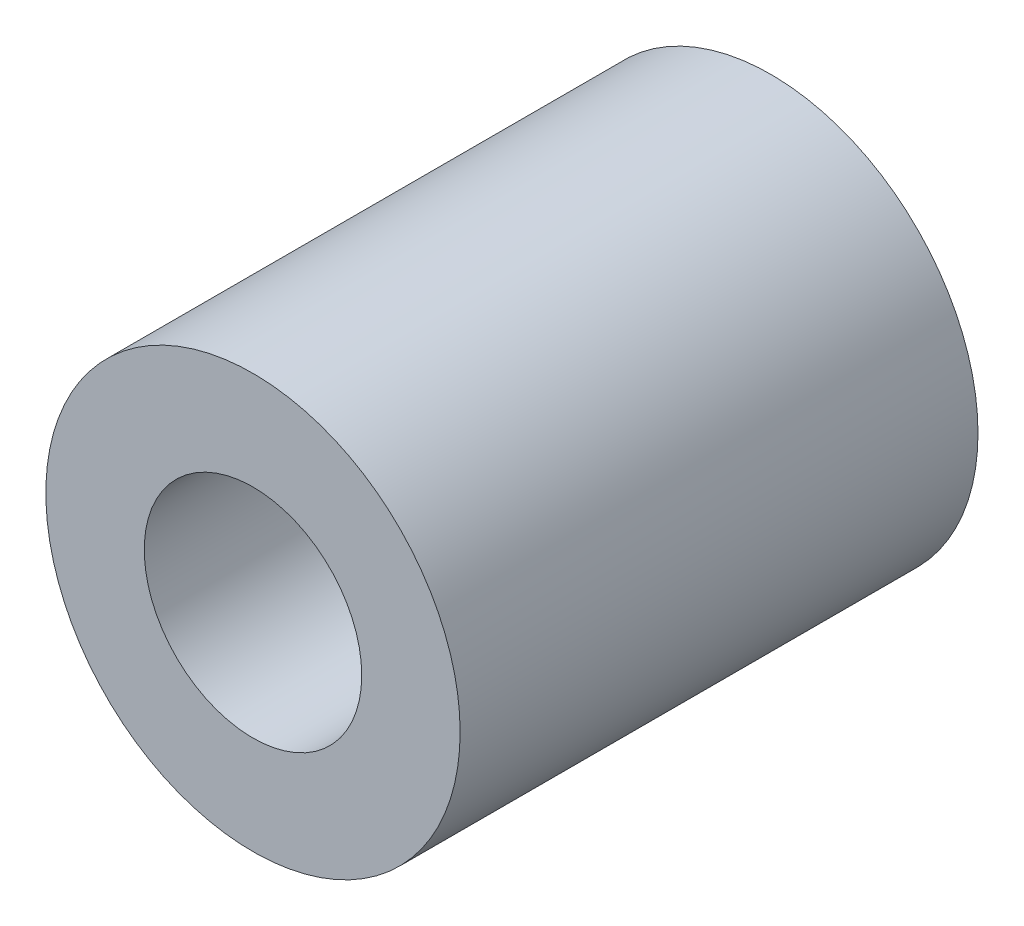
ISO-10303-21;
HEADER;
FILE_DESCRIPTION(('STEP AP214'),'2;1');
FILE_NAME('part.step','',(''),(''),'','','');
FILE_SCHEMA(('AUTOMOTIVE_DESIGN { 1 0 10303 214 1 1 1 1 }'));
ENDSEC;
DATA;
#1=APPLICATION_CONTEXT('core data for automotive mechanical design processes');
#2=APPLICATION_PROTOCOL_DEFINITION('international standard','automotive_design',2000,#1);
#3=PRODUCT_CONTEXT('',#1,'mechanical');
#4=PRODUCT('Part','Part','',(#3));
#5=PRODUCT_RELATED_PRODUCT_CATEGORY('part','',(#4));
#6=PRODUCT_DEFINITION_FORMATION('','',#4);
#7=PRODUCT_DEFINITION_CONTEXT('part definition',#1,'design');
#8=PRODUCT_DEFINITION('design','',#6,#7);
#9=PRODUCT_DEFINITION_SHAPE('','',#8);
#10=(LENGTH_UNIT() NAMED_UNIT(*) SI_UNIT(.MILLI.,.METRE.));
#11=(NAMED_UNIT(*) PLANE_ANGLE_UNIT() SI_UNIT($,.RADIAN.));
#12=(NAMED_UNIT(*) SI_UNIT($,.STERADIAN.) SOLID_ANGLE_UNIT());
#13=UNCERTAINTY_MEASURE_WITH_UNIT(LENGTH_MEASURE(1.E-05),#10,'distance_accuracy_value','');
#14=(GEOMETRIC_REPRESENTATION_CONTEXT(3) GLOBAL_UNCERTAINTY_ASSIGNED_CONTEXT((#13)) GLOBAL_UNIT_ASSIGNED_CONTEXT((#10,
#11,#12)) REPRESENTATION_CONTEXT('',''));
#15=CARTESIAN_POINT('',(0.,0.,0.));
#16=DIRECTION('',(0.,0.,1.));
#17=DIRECTION('',(1.,0.,0.));
#18=AXIS2_PLACEMENT_3D('',#15,#16,#17);
#19=CARTESIAN_POINT('',(0.,0.,5.));
#20=DIRECTION('',(0.,0.,1.));
#21=DIRECTION('',(1.,0.,0.));
#22=AXIS2_PLACEMENT_3D('',#19,#20,#21);
#23=PLANE('',#22);
#24=CARTESIAN_POINT('',(0.,0.,5.));
#25=DIRECTION('',(0.,0.,1.));
#26=DIRECTION('',(1.,0.,0.));
#27=AXIS2_PLACEMENT_3D('',#24,#25,#26);
#28=CIRCLE('',#27,4.);
#29=CARTESIAN_POINT('',(4.,0.,5.));
#30=VERTEX_POINT('',#29);
#31=EDGE_CURVE('E10',#30,#30,#28,.T.);
#32=ORIENTED_EDGE('',*,*,#31,.T.);
#33=EDGE_LOOP('',(#32));
#34=FACE_BOUND('',#33,.T.);
#35=CARTESIAN_POINT('',(0.,0.,5.));
#36=DIRECTION('',(0.,0.,1.));
#37=DIRECTION('',(1.,0.,0.));
#38=AXIS2_PLACEMENT_3D('',#35,#36,#37);
#39=CIRCLE('',#38,2.1);
#40=CARTESIAN_POINT('',(2.1,0.,5.));
#41=VERTEX_POINT('',#40);
#42=EDGE_CURVE('E37',#41,#41,#39,.T.);
#43=ORIENTED_EDGE('',*,*,#42,.F.);
#44=EDGE_LOOP('',(#43));
#45=FACE_BOUND('',#44,.T.);
#46=ADVANCED_FACE('F30',(#34,#45),#23,.T.);
#47=CARTESIAN_POINT('',(0.,0.,5.));
#48=DIRECTION('',(0.,0.,-1.));
#49=DIRECTION('',(-1.,0.,0.));
#50=AXIS2_PLACEMENT_3D('',#47,#48,#49);
#51=CYLINDRICAL_SURFACE('',#50,4.);
#52=ORIENTED_EDGE('',*,*,#31,.F.);
#53=EDGE_LOOP('',(#52));
#54=FACE_BOUND('',#53,.T.);
#55=CARTESIAN_POINT('',(0.,0.,-5.));
#56=DIRECTION('',(0.,0.,1.));
#57=DIRECTION('',(1.,0.,0.));
#58=AXIS2_PLACEMENT_3D('',#55,#56,#57);
#59=CIRCLE('',#58,4.);
#60=CARTESIAN_POINT('',(4.,0.,-5.));
#61=VERTEX_POINT('',#60);
#62=EDGE_CURVE('E41',#61,#61,#59,.T.);
#63=ORIENTED_EDGE('',*,*,#62,.T.);
#64=EDGE_LOOP('',(#63));
#65=FACE_BOUND('',#64,.T.);
#66=ADVANCED_FACE('F32',(#54,#65),#51,.T.);
#67=CARTESIAN_POINT('',(0.,0.,5.));
#68=DIRECTION('',(0.,0.,-1.));
#69=DIRECTION('',(-1.,0.,0.));
#70=AXIS2_PLACEMENT_3D('',#67,#68,#69);
#71=CYLINDRICAL_SURFACE('',#70,2.1);
#72=ORIENTED_EDGE('',*,*,#42,.T.);
#73=EDGE_LOOP('',(#72));
#74=FACE_BOUND('',#73,.T.);
#75=CARTESIAN_POINT('',(0.,0.,-5.));
#76=DIRECTION('',(0.,0.,1.));
#77=DIRECTION('',(1.,0.,0.));
#78=AXIS2_PLACEMENT_3D('',#75,#76,#77);
#79=CIRCLE('',#78,2.1);
#80=CARTESIAN_POINT('',(2.1,0.,-5.));
#81=VERTEX_POINT('',#80);
#82=EDGE_CURVE('E45',#81,#81,#79,.T.);
#83=ORIENTED_EDGE('',*,*,#82,.F.);
#84=EDGE_LOOP('',(#83));
#85=FACE_BOUND('',#84,.T.);
#86=ADVANCED_FACE('F54',(#74,#85),#71,.F.);
#87=CARTESIAN_POINT('',(0.,0.,-5.));
#88=DIRECTION('',(0.,0.,1.));
#89=DIRECTION('',(1.,0.,0.));
#90=AXIS2_PLACEMENT_3D('',#87,#88,#89);
#91=PLANE('',#90);
#92=ORIENTED_EDGE('',*,*,#82,.T.);
#93=EDGE_LOOP('',(#92));
#94=FACE_BOUND('',#93,.T.);
#95=ORIENTED_EDGE('',*,*,#62,.F.);
#96=EDGE_LOOP('',(#95));
#97=FACE_BOUND('',#96,.T.);
#98=ADVANCED_FACE('F51',(#94,#97),#91,.F.);
#99=CLOSED_SHELL('',(#46,#66,#86,#98));
#100=MANIFOLD_SOLID_BREP('B2',#99);
#101=ADVANCED_BREP_SHAPE_REPRESENTATION('',(#18,#100),#14);
#102=SHAPE_DEFINITION_REPRESENTATION(#9,#101);
ENDSEC;
END-ISO-10303-21;
